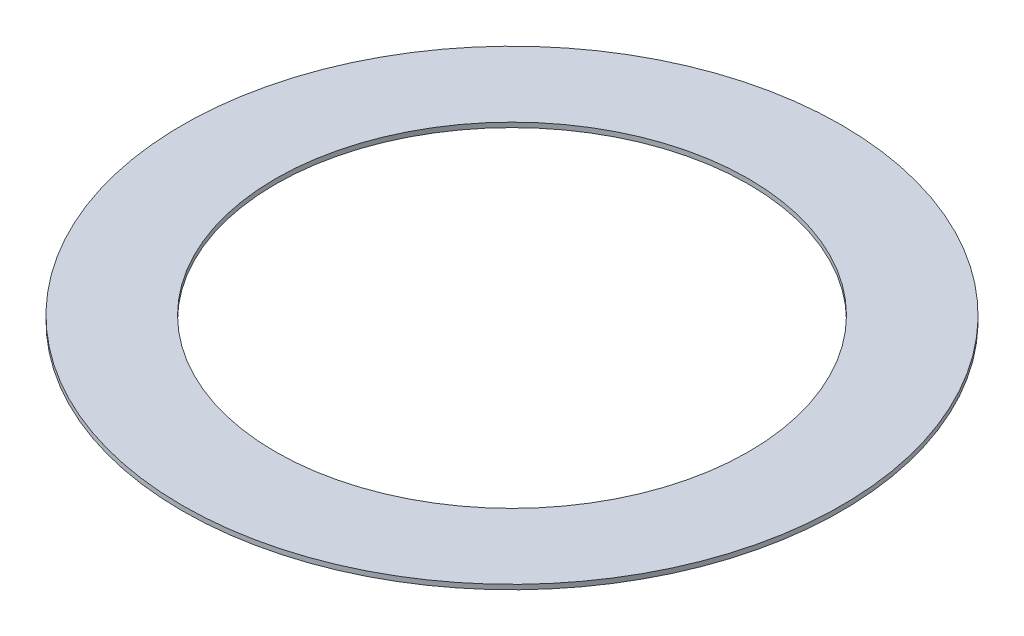
ISO-10303-21;
HEADER;
FILE_DESCRIPTION(('STEP AP214'),'2;1');
FILE_NAME('part.step','',(''),(''),'','','');
FILE_SCHEMA(('AUTOMOTIVE_DESIGN { 1 0 10303 214 1 1 1 1 }'));
ENDSEC;
DATA;
#1=APPLICATION_CONTEXT('core data for automotive mechanical design processes');
#2=APPLICATION_PROTOCOL_DEFINITION('international standard','automotive_design',2000,#1);
#3=PRODUCT_CONTEXT('',#1,'mechanical');
#4=PRODUCT('Part','Part','',(#3));
#5=PRODUCT_RELATED_PRODUCT_CATEGORY('part','',(#4));
#6=PRODUCT_DEFINITION_FORMATION('','',#4);
#7=PRODUCT_DEFINITION_CONTEXT('part definition',#1,'design');
#8=PRODUCT_DEFINITION('design','',#6,#7);
#9=PRODUCT_DEFINITION_SHAPE('','',#8);
#10=(LENGTH_UNIT() NAMED_UNIT(*) SI_UNIT(.MILLI.,.METRE.));
#11=(NAMED_UNIT(*) PLANE_ANGLE_UNIT() SI_UNIT($,.RADIAN.));
#12=(NAMED_UNIT(*) SI_UNIT($,.STERADIAN.) SOLID_ANGLE_UNIT());
#13=UNCERTAINTY_MEASURE_WITH_UNIT(LENGTH_MEASURE(1.E-05),#10,'distance_accuracy_value','');
#14=(GEOMETRIC_REPRESENTATION_CONTEXT(3) GLOBAL_UNCERTAINTY_ASSIGNED_CONTEXT((#13)) GLOBAL_UNIT_ASSIGNED_CONTEXT((#10,
#11,#12)) REPRESENTATION_CONTEXT('',''));
#15=CARTESIAN_POINT('',(0.,0.,0.));
#16=DIRECTION('',(0.,0.,1.));
#17=DIRECTION('',(1.,0.,0.));
#18=AXIS2_PLACEMENT_3D('',#15,#16,#17);
#19=CARTESIAN_POINT('',(0.,0.149999999999997,0.));
#20=DIRECTION('',(0.,1.,0.));
#21=DIRECTION('',(0.,0.,1.));
#22=AXIS2_PLACEMENT_3D('',#19,#20,#21);
#23=PLANE('',#22);
#24=CARTESIAN_POINT('',(0.,0.149999999999997,0.));
#25=DIRECTION('',(0.,1.,0.));
#26=DIRECTION('',(0.,0.,1.));
#27=AXIS2_PLACEMENT_3D('',#24,#25,#26);
#28=CIRCLE('',#27,10.45);
#29=CARTESIAN_POINT('',(0.,0.149999999999997,10.45));
#30=VERTEX_POINT('',#29);
#31=EDGE_CURVE('E10',#30,#30,#28,.T.);
#32=ORIENTED_EDGE('',*,*,#31,.T.);
#33=EDGE_LOOP('',(#32));
#34=FACE_BOUND('',#33,.T.);
#35=CARTESIAN_POINT('',(0.,0.149999999999997,0.));
#36=DIRECTION('',(0.,1.,0.));
#37=DIRECTION('',(0.,0.,1.));
#38=AXIS2_PLACEMENT_3D('',#35,#36,#37);
#39=CIRCLE('',#38,7.5);
#40=CARTESIAN_POINT('',(0.,0.149999999999997,7.5));
#41=VERTEX_POINT('',#40);
#42=EDGE_CURVE('E40',#41,#41,#39,.T.);
#43=ORIENTED_EDGE('',*,*,#42,.F.);
#44=EDGE_LOOP('',(#43));
#45=FACE_BOUND('',#44,.T.);
#46=ADVANCED_FACE('F29',(#34,#45),#23,.T.);
#47=CARTESIAN_POINT('',(0.,0.,0.));
#48=DIRECTION('',(0.,1.,0.));
#49=DIRECTION('',(0.,0.,1.));
#50=AXIS2_PLACEMENT_3D('',#47,#48,#49);
#51=PLANE('',#50);
#52=CARTESIAN_POINT('',(0.,0.,0.));
#53=DIRECTION('',(0.,1.,0.));
#54=DIRECTION('',(0.,0.,1.));
#55=AXIS2_PLACEMENT_3D('',#52,#53,#54);
#56=CIRCLE('',#55,10.45);
#57=CARTESIAN_POINT('',(0.,0.,10.45));
#58=VERTEX_POINT('',#57);
#59=EDGE_CURVE('E36',#58,#58,#56,.T.);
#60=ORIENTED_EDGE('',*,*,#59,.F.);
#61=EDGE_LOOP('',(#60));
#62=FACE_BOUND('',#61,.T.);
#63=CARTESIAN_POINT('',(0.,0.,0.));
#64=DIRECTION('',(0.,1.,0.));
#65=DIRECTION('',(0.,0.,1.));
#66=AXIS2_PLACEMENT_3D('',#63,#64,#65);
#67=CIRCLE('',#66,7.5);
#68=CARTESIAN_POINT('',(0.,0.,7.5));
#69=VERTEX_POINT('',#68);
#70=EDGE_CURVE('E44',#69,#69,#67,.T.);
#71=ORIENTED_EDGE('',*,*,#70,.T.);
#72=EDGE_LOOP('',(#71));
#73=FACE_BOUND('',#72,.T.);
#74=ADVANCED_FACE('F50',(#62,#73),#51,.F.);
#75=CARTESIAN_POINT('',(0.,0.149999999999997,0.));
#76=DIRECTION('',(0.,-1.,0.));
#77=DIRECTION('',(0.,0.,-1.));
#78=AXIS2_PLACEMENT_3D('',#75,#76,#77);
#79=CYLINDRICAL_SURFACE('',#78,10.45);
#80=ORIENTED_EDGE('',*,*,#31,.F.);
#81=EDGE_LOOP('',(#80));
#82=FACE_BOUND('',#81,.T.);
#83=ORIENTED_EDGE('',*,*,#59,.T.);
#84=EDGE_LOOP('',(#83));
#85=FACE_BOUND('',#84,.T.);
#86=ADVANCED_FACE('F31',(#82,#85),#79,.T.);
#87=CARTESIAN_POINT('',(0.,0.149999999999997,0.));
#88=DIRECTION('',(0.,-1.,0.));
#89=DIRECTION('',(0.,0.,-1.));
#90=AXIS2_PLACEMENT_3D('',#87,#88,#89);
#91=CYLINDRICAL_SURFACE('',#90,7.5);
#92=ORIENTED_EDGE('',*,*,#42,.T.);
#93=EDGE_LOOP('',(#92));
#94=FACE_BOUND('',#93,.T.);
#95=ORIENTED_EDGE('',*,*,#70,.F.);
#96=EDGE_LOOP('',(#95));
#97=FACE_BOUND('',#96,.T.);
#98=ADVANCED_FACE('F52',(#94,#97),#91,.F.);
#99=CLOSED_SHELL('',(#46,#74,#86,#98));
#100=MANIFOLD_SOLID_BREP('B2',#99);
#101=ADVANCED_BREP_SHAPE_REPRESENTATION('',(#18,#100),#14);
#102=SHAPE_DEFINITION_REPRESENTATION(#9,#101);
ENDSEC;
END-ISO-10303-21;
